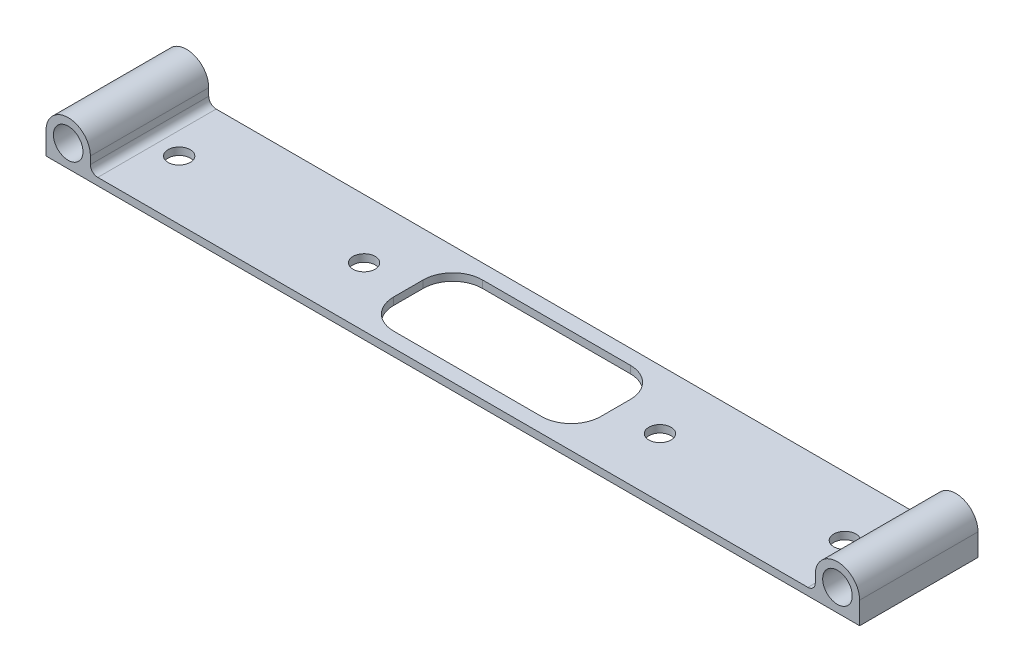
ISO-10303-21;
HEADER;
FILE_DESCRIPTION(('STEP AP214'),'2;1');
FILE_NAME('part.step','',(''),(''),'','','');
FILE_SCHEMA(('AUTOMOTIVE_DESIGN { 1 0 10303 214 1 1 1 1 }'));
ENDSEC;
DATA;
#1=APPLICATION_CONTEXT('core data for automotive mechanical design processes');
#2=APPLICATION_PROTOCOL_DEFINITION('international standard','automotive_design',2000,#1);
#3=PRODUCT_CONTEXT('',#1,'mechanical');
#4=PRODUCT('Part','Part','',(#3));
#5=PRODUCT_RELATED_PRODUCT_CATEGORY('part','',(#4));
#6=PRODUCT_DEFINITION_FORMATION('','',#4);
#7=PRODUCT_DEFINITION_CONTEXT('part definition',#1,'design');
#8=PRODUCT_DEFINITION('design','',#6,#7);
#9=PRODUCT_DEFINITION_SHAPE('','',#8);
#10=(LENGTH_UNIT() NAMED_UNIT(*) SI_UNIT(.MILLI.,.METRE.));
#11=(NAMED_UNIT(*) PLANE_ANGLE_UNIT() SI_UNIT($,.RADIAN.));
#12=(NAMED_UNIT(*) SI_UNIT($,.STERADIAN.) SOLID_ANGLE_UNIT());
#13=UNCERTAINTY_MEASURE_WITH_UNIT(LENGTH_MEASURE(1.E-05),#10,'distance_accuracy_value','');
#14=(GEOMETRIC_REPRESENTATION_CONTEXT(3) GLOBAL_UNCERTAINTY_ASSIGNED_CONTEXT((#13)) GLOBAL_UNIT_ASSIGNED_CONTEXT((#10,
#11,#12)) REPRESENTATION_CONTEXT('',''));
#15=CARTESIAN_POINT('',(0.,0.,0.));
#16=DIRECTION('',(0.,0.,1.));
#17=DIRECTION('',(1.,0.,0.));
#18=AXIS2_PLACEMENT_3D('',#15,#16,#17);
#19=CARTESIAN_POINT('',(-9.525,0.,50.8));
#20=DIRECTION('',(1.,0.,0.));
#21=DIRECTION('',(0.,1.,0.));
#22=AXIS2_PLACEMENT_3D('',#19,#20,#21);
#23=PLANE('',#22);
#24=DIRECTION('',(0.,-1.,0.));
#25=VECTOR('',#24,1.);
#26=CARTESIAN_POINT('',(-9.525,0.,0.));
#27=LINE('',#26,#25);
#28=CARTESIAN_POINT('',(-9.525,0.,0.));
#29=VERTEX_POINT('',#28);
#30=CARTESIAN_POINT('',(-9.525,-9.525,0.));
#31=VERTEX_POINT('',#30);
#32=EDGE_CURVE('E238',#29,#31,#27,.T.);
#33=ORIENTED_EDGE('',*,*,#32,.T.);
#34=DIRECTION('',(0.,0.,-1.));
#35=VECTOR('',#34,1.);
#36=CARTESIAN_POINT('',(-9.525,-9.525,50.8));
#37=LINE('',#36,#35);
#38=CARTESIAN_POINT('',(-9.525,-9.525,50.8));
#39=VERTEX_POINT('',#38);
#40=EDGE_CURVE('E253',#39,#31,#37,.T.);
#41=ORIENTED_EDGE('',*,*,#40,.F.);
#42=DIRECTION('',(0.,-1.,0.));
#43=VECTOR('',#42,1.);
#44=CARTESIAN_POINT('',(-9.525,0.,50.8));
#45=LINE('',#44,#43);
#46=CARTESIAN_POINT('',(-9.525,0.,50.8));
#47=VERTEX_POINT('',#46);
#48=EDGE_CURVE('E222',#47,#39,#45,.T.);
#49=ORIENTED_EDGE('',*,*,#48,.F.);
#50=DIRECTION('',(0.,0.,-1.));
#51=VECTOR('',#50,1.);
#52=CARTESIAN_POINT('',(-9.525,0.,50.8));
#53=LINE('',#52,#51);
#54=EDGE_CURVE('E235',#47,#29,#53,.T.);
#55=ORIENTED_EDGE('',*,*,#54,.T.);
#56=EDGE_LOOP('',(#33,#41,#49,#55));
#57=FACE_BOUND('',#56,.T.);
#58=ADVANCED_FACE('F38',(#57),#23,.F.);
#59=CARTESIAN_POINT('',(0.,-9.52500000000001,50.8));
#60=DIRECTION('',(0.,1.,0.));
#61=DIRECTION('',(-1.,0.,0.));
#62=AXIS2_PLACEMENT_3D('',#59,#60,#61);
#63=PLANE('',#62);
#64=DIRECTION('',(1.,0.,0.));
#65=VECTOR('',#64,1.);
#66=CARTESIAN_POINT('',(0.,-9.52500000000029,6.35));
#67=LINE('',#66,#65);
#68=CARTESIAN_POINT('',(133.35,-9.52500000000029,6.35));
#69=VERTEX_POINT('',#68);
#70=CARTESIAN_POINT('',(196.85,-9.52500000000029,6.35));
#71=VERTEX_POINT('',#70);
#72=EDGE_CURVE('E670',#69,#71,#67,.T.);
#73=ORIENTED_EDGE('',*,*,#72,.F.);
#74=CARTESIAN_POINT('',(133.35,-9.52500000000013,19.05));
#75=DIRECTION('',(0.,1.,0.));
#76=DIRECTION('',(-1.,0.,0.));
#77=AXIS2_PLACEMENT_3D('',#74,#75,#76);
#78=CIRCLE('',#77,12.7);
#79=CARTESIAN_POINT('',(120.65,-9.52500000000029,19.05));
#80=VERTEX_POINT('',#79);
#81=EDGE_CURVE('E290',#69,#80,#78,.T.);
#82=ORIENTED_EDGE('',*,*,#81,.T.);
#83=DIRECTION('',(0.,0.,1.));
#84=VECTOR('',#83,1.);
#85=CARTESIAN_POINT('',(120.65,-9.52500000000029,0.));
#86=LINE('',#85,#84);
#87=CARTESIAN_POINT('',(120.65,-9.52500000000029,31.75));
#88=VERTEX_POINT('',#87);
#89=EDGE_CURVE('E675',#80,#88,#86,.T.);
#90=ORIENTED_EDGE('',*,*,#89,.T.);
#91=CARTESIAN_POINT('',(133.35,-9.52500000000013,31.75));
#92=DIRECTION('',(0.,1.,0.));
#93=DIRECTION('',(-1.,0.,0.));
#94=AXIS2_PLACEMENT_3D('',#91,#92,#93);
#95=CIRCLE('',#94,12.7);
#96=CARTESIAN_POINT('',(133.35,-9.52500000000029,44.45));
#97=VERTEX_POINT('',#96);
#98=EDGE_CURVE('E286',#88,#97,#95,.T.);
#99=ORIENTED_EDGE('',*,*,#98,.T.);
#100=DIRECTION('',(1.,0.,0.));
#101=VECTOR('',#100,1.);
#102=CARTESIAN_POINT('',(0.,-9.52500000000029,44.45));
#103=LINE('',#102,#101);
#104=CARTESIAN_POINT('',(196.85,-9.52500000000029,44.45));
#105=VERTEX_POINT('',#104);
#106=EDGE_CURVE('E690',#97,#105,#103,.T.);
#107=ORIENTED_EDGE('',*,*,#106,.T.);
#108=CARTESIAN_POINT('',(196.85,-9.52500000000019,31.75));
#109=DIRECTION('',(0.,1.,0.));
#110=DIRECTION('',(-1.,0.,0.));
#111=AXIS2_PLACEMENT_3D('',#108,#109,#110);
#112=CIRCLE('',#111,12.7);
#113=CARTESIAN_POINT('',(209.55,-9.52500000000029,31.75));
#114=VERTEX_POINT('',#113);
#115=EDGE_CURVE('E282',#105,#114,#112,.T.);
#116=ORIENTED_EDGE('',*,*,#115,.T.);
#117=DIRECTION('',(0.,0.,1.));
#118=VECTOR('',#117,1.);
#119=CARTESIAN_POINT('',(209.55,-9.52500000000029,0.));
#120=LINE('',#119,#118);
#121=CARTESIAN_POINT('',(209.55,-9.52500000000029,19.05));
#122=VERTEX_POINT('',#121);
#123=EDGE_CURVE('E687',#122,#114,#120,.T.);
#124=ORIENTED_EDGE('',*,*,#123,.F.);
#125=CARTESIAN_POINT('',(196.85,-9.52500000000019,19.05));
#126=DIRECTION('',(0.,1.,0.));
#127=DIRECTION('',(-1.,0.,0.));
#128=AXIS2_PLACEMENT_3D('',#125,#126,#127);
#129=CIRCLE('',#128,12.7);
#130=EDGE_CURVE('E278',#122,#71,#129,.T.);
#131=ORIENTED_EDGE('',*,*,#130,.T.);
#132=EDGE_LOOP('',(#73,#82,#90,#99,#107,#116,#124,#131));
#133=FACE_BOUND('',#132,.T.);
#134=CARTESIAN_POINT('',(307.975,-9.52500000000029,25.4));
#135=DIRECTION('',(0.,1.,0.));
#136=DIRECTION('',(-1.,0.,0.));
#137=AXIS2_PLACEMENT_3D('',#134,#135,#136);
#138=CIRCLE('',#137,4.76250000000001);
#139=CARTESIAN_POINT('',(303.2125,-9.52500000000029,25.4));
#140=VERTEX_POINT('',#139);
#141=EDGE_CURVE('E200',#140,#140,#138,.F.);
#142=ORIENTED_EDGE('',*,*,#141,.F.);
#143=EDGE_LOOP('',(#142));
#144=FACE_BOUND('',#143,.T.);
#145=CARTESIAN_POINT('',(228.6,-9.52500000000022,25.4));
#146=DIRECTION('',(0.,1.,0.));
#147=DIRECTION('',(-1.,0.,0.));
#148=AXIS2_PLACEMENT_3D('',#145,#146,#147);
#149=CIRCLE('',#148,4.76250000000001);
#150=CARTESIAN_POINT('',(223.8375,-9.52500000000021,25.4));
#151=VERTEX_POINT('',#150);
#152=EDGE_CURVE('E662',#151,#151,#149,.F.);
#153=ORIENTED_EDGE('',*,*,#152,.F.);
#154=EDGE_LOOP('',(#153));
#155=FACE_BOUND('',#154,.T.);
#156=CARTESIAN_POINT('',(22.225,-9.52500000000003,25.4));
#157=DIRECTION('',(0.,1.,0.));
#158=DIRECTION('',(-1.,0.,0.));
#159=AXIS2_PLACEMENT_3D('',#156,#157,#158);
#160=CIRCLE('',#159,4.76250000000001);
#161=CARTESIAN_POINT('',(17.4625,-9.52500000000003,25.4));
#162=VERTEX_POINT('',#161);
#163=EDGE_CURVE('E215',#162,#162,#160,.T.);
#164=ORIENTED_EDGE('',*,*,#163,.T.);
#165=EDGE_LOOP('',(#164));
#166=FACE_BOUND('',#165,.T.);
#167=CARTESIAN_POINT('',(101.6,-9.5250000000001,25.4));
#168=DIRECTION('',(0.,1.,0.));
#169=DIRECTION('',(-1.,0.,0.));
#170=AXIS2_PLACEMENT_3D('',#167,#168,#169);
#171=CIRCLE('',#170,4.76250000000001);
#172=CARTESIAN_POINT('',(96.8375,-9.5250000000001,25.4));
#173=VERTEX_POINT('',#172);
#174=EDGE_CURVE('E210',#173,#173,#171,.T.);
#175=ORIENTED_EDGE('',*,*,#174,.T.);
#176=EDGE_LOOP('',(#175));
#177=FACE_BOUND('',#176,.T.);
#178=DIRECTION('',(1.,0.,0.));
#179=VECTOR('',#178,1.);
#180=CARTESIAN_POINT('',(0.,-9.52500000000001,0.));
#181=LINE('',#180,#179);
#182=CARTESIAN_POINT('',(339.725,-9.525,0.));
#183=VERTEX_POINT('',#182);
#184=EDGE_CURVE('E241',#31,#183,#181,.T.);
#185=ORIENTED_EDGE('',*,*,#184,.T.);
#186=DIRECTION('',(0.,0.,-1.));
#187=VECTOR('',#186,1.);
#188=CARTESIAN_POINT('',(339.725,-9.525,50.8));
#189=LINE('',#188,#187);
#190=CARTESIAN_POINT('',(339.725,-9.525,50.8));
#191=VERTEX_POINT('',#190);
#192=EDGE_CURVE('E196',#191,#183,#189,.T.);
#193=ORIENTED_EDGE('',*,*,#192,.F.);
#194=DIRECTION('',(1.,0.,0.));
#195=VECTOR('',#194,1.);
#196=CARTESIAN_POINT('',(0.,-9.52500000000001,50.8));
#197=LINE('',#196,#195);
#198=EDGE_CURVE('E186',#39,#191,#197,.T.);
#199=ORIENTED_EDGE('',*,*,#198,.F.);
#200=ORIENTED_EDGE('',*,*,#40,.T.);
#201=EDGE_LOOP('',(#185,#193,#199,#200));
#202=FACE_BOUND('',#201,.T.);
#203=ADVANCED_FACE('F328',(#133,#144,#155,#166,#177,#202),#63,.F.);
#204=CARTESIAN_POINT('',(0.,-6.35,50.8));
#205=DIRECTION('',(0.,1.,0.));
#206=DIRECTION('',(-1.,0.,0.));
#207=AXIS2_PLACEMENT_3D('',#204,#205,#206);
#208=PLANE('',#207);
#209=DIRECTION('',(0.,0.,1.));
#210=VECTOR('',#209,1.);
#211=CARTESIAN_POINT('',(120.65,-6.35,0.));
#212=LINE('',#211,#210);
#213=CARTESIAN_POINT('',(120.65,-6.35,19.05));
#214=VERTEX_POINT('',#213);
#215=CARTESIAN_POINT('',(120.65,-6.35,31.75));
#216=VERTEX_POINT('',#215);
#217=EDGE_CURVE('E682',#214,#216,#212,.T.);
#218=ORIENTED_EDGE('',*,*,#217,.F.);
#219=CARTESIAN_POINT('',(133.35,-6.35,19.05));
#220=DIRECTION('',(0.,1.,0.));
#221=DIRECTION('',(-1.,0.,0.));
#222=AXIS2_PLACEMENT_3D('',#219,#220,#221);
#223=CIRCLE('',#222,12.7);
#224=CARTESIAN_POINT('',(133.35,-6.35,6.35));
#225=VERTEX_POINT('',#224);
#226=EDGE_CURVE('E288',#214,#225,#223,.F.);
#227=ORIENTED_EDGE('',*,*,#226,.T.);
#228=DIRECTION('',(1.,0.,0.));
#229=VECTOR('',#228,1.);
#230=CARTESIAN_POINT('',(0.,-6.35,6.35));
#231=LINE('',#230,#229);
#232=CARTESIAN_POINT('',(196.85,-6.35,6.35));
#233=VERTEX_POINT('',#232);
#234=EDGE_CURVE('E672',#225,#233,#231,.T.);
#235=ORIENTED_EDGE('',*,*,#234,.T.);
#236=CARTESIAN_POINT('',(196.85,-6.35,19.05));
#237=DIRECTION('',(0.,1.,0.));
#238=DIRECTION('',(-1.,0.,0.));
#239=AXIS2_PLACEMENT_3D('',#236,#237,#238);
#240=CIRCLE('',#239,12.7);
#241=CARTESIAN_POINT('',(209.55,-6.35,19.05));
#242=VERTEX_POINT('',#241);
#243=EDGE_CURVE('E276',#233,#242,#240,.F.);
#244=ORIENTED_EDGE('',*,*,#243,.T.);
#245=DIRECTION('',(0.,0.,1.));
#246=VECTOR('',#245,1.);
#247=CARTESIAN_POINT('',(209.55,-6.35,0.));
#248=LINE('',#247,#246);
#249=CARTESIAN_POINT('',(209.55,-6.35,31.75));
#250=VERTEX_POINT('',#249);
#251=EDGE_CURVE('E676',#242,#250,#248,.T.);
#252=ORIENTED_EDGE('',*,*,#251,.T.);
#253=CARTESIAN_POINT('',(196.85,-6.35,31.75));
#254=DIRECTION('',(0.,1.,0.));
#255=DIRECTION('',(-1.,0.,0.));
#256=AXIS2_PLACEMENT_3D('',#253,#254,#255);
#257=CIRCLE('',#256,12.7);
#258=CARTESIAN_POINT('',(196.85,-6.35,44.45));
#259=VERTEX_POINT('',#258);
#260=EDGE_CURVE('E280',#250,#259,#257,.F.);
#261=ORIENTED_EDGE('',*,*,#260,.T.);
#262=DIRECTION('',(1.,0.,0.));
#263=VECTOR('',#262,1.);
#264=CARTESIAN_POINT('',(0.,-6.35,44.45));
#265=LINE('',#264,#263);
#266=CARTESIAN_POINT('',(133.35,-6.35,44.45));
#267=VERTEX_POINT('',#266);
#268=EDGE_CURVE('E679',#267,#259,#265,.T.);
#269=ORIENTED_EDGE('',*,*,#268,.F.);
#270=CARTESIAN_POINT('',(133.35,-6.35,31.75));
#271=DIRECTION('',(0.,1.,0.));
#272=DIRECTION('',(-1.,0.,0.));
#273=AXIS2_PLACEMENT_3D('',#270,#271,#272);
#274=CIRCLE('',#273,12.7);
#275=EDGE_CURVE('E284',#267,#216,#274,.F.);
#276=ORIENTED_EDGE('',*,*,#275,.T.);
#277=EDGE_LOOP('',(#218,#227,#235,#244,#252,#261,#269,#276));
#278=FACE_BOUND('',#277,.T.);
#279=CARTESIAN_POINT('',(307.975,-6.35,25.4));
#280=DIRECTION('',(0.,-1.,0.));
#281=DIRECTION('',(1.,0.,0.));
#282=AXIS2_PLACEMENT_3D('',#279,#280,#281);
#283=CIRCLE('',#282,4.76250000000001);
#284=CARTESIAN_POINT('',(312.7375,-6.35,25.4));
#285=VERTEX_POINT('',#284);
#286=EDGE_CURVE('E664',#285,#285,#283,.T.);
#287=ORIENTED_EDGE('',*,*,#286,.T.);
#288=EDGE_LOOP('',(#287));
#289=FACE_BOUND('',#288,.T.);
#290=CARTESIAN_POINT('',(228.6,-6.35000000000001,25.4));
#291=DIRECTION('',(0.,-1.,0.));
#292=DIRECTION('',(1.,0.,0.));
#293=AXIS2_PLACEMENT_3D('',#290,#291,#292);
#294=CIRCLE('',#293,4.76250000000001);
#295=CARTESIAN_POINT('',(233.3625,-6.35000000000001,25.4));
#296=VERTEX_POINT('',#295);
#297=EDGE_CURVE('E659',#296,#296,#294,.T.);
#298=ORIENTED_EDGE('',*,*,#297,.T.);
#299=EDGE_LOOP('',(#298));
#300=FACE_BOUND('',#299,.T.);
#301=CARTESIAN_POINT('',(22.225,-6.35,25.4));
#302=DIRECTION('',(0.,1.,0.));
#303=DIRECTION('',(-1.,0.,0.));
#304=AXIS2_PLACEMENT_3D('',#301,#302,#303);
#305=CIRCLE('',#304,4.76250000000001);
#306=CARTESIAN_POINT('',(17.4625,-6.35,25.4));
#307=VERTEX_POINT('',#306);
#308=EDGE_CURVE('E207',#307,#307,#305,.T.);
#309=ORIENTED_EDGE('',*,*,#308,.F.);
#310=EDGE_LOOP('',(#309));
#311=FACE_BOUND('',#310,.T.);
#312=CARTESIAN_POINT('',(101.6,-6.35000000000001,25.4));
#313=DIRECTION('',(0.,1.,0.));
#314=DIRECTION('',(-1.,0.,0.));
#315=AXIS2_PLACEMENT_3D('',#312,#313,#314);
#316=CIRCLE('',#315,4.76250000000001);
#317=CARTESIAN_POINT('',(96.8375,-6.35000000000001,25.4));
#318=VERTEX_POINT('',#317);
#319=EDGE_CURVE('E172',#318,#318,#316,.T.);
#320=ORIENTED_EDGE('',*,*,#319,.F.);
#321=EDGE_LOOP('',(#320));
#322=FACE_BOUND('',#321,.T.);
#323=DIRECTION('',(1.,0.,0.));
#324=VECTOR('',#323,1.);
#325=CARTESIAN_POINT('',(0.,-6.35,0.));
#326=LINE('',#325,#324);
#327=CARTESIAN_POINT('',(12.7,-6.35,0.));
#328=VERTEX_POINT('',#327);
#329=CARTESIAN_POINT('',(317.5,-6.35,0.));
#330=VERTEX_POINT('',#329);
#331=EDGE_CURVE('E243',#328,#330,#326,.T.);
#332=ORIENTED_EDGE('',*,*,#331,.F.);
#333=DIRECTION('',(0.,0.,-1.));
#334=VECTOR('',#333,1.);
#335=CARTESIAN_POINT('',(12.7,-6.35,50.8));
#336=LINE('',#335,#334);
#337=CARTESIAN_POINT('',(12.7,-6.35,50.8));
#338=VERTEX_POINT('',#337);
#339=EDGE_CURVE('E298',#328,#338,#336,.F.);
#340=ORIENTED_EDGE('',*,*,#339,.T.);
#341=DIRECTION('',(1.,0.,0.));
#342=VECTOR('',#341,1.);
#343=CARTESIAN_POINT('',(0.,-6.35,50.8));
#344=LINE('',#343,#342);
#345=CARTESIAN_POINT('',(317.5,-6.35,50.8));
#346=VERTEX_POINT('',#345);
#347=EDGE_CURVE('E226',#338,#346,#344,.T.);
#348=ORIENTED_EDGE('',*,*,#347,.T.);
#349=DIRECTION('',(0.,0.,-1.));
#350=VECTOR('',#349,1.);
#351=CARTESIAN_POINT('',(317.5,-6.35,50.8));
#352=LINE('',#351,#350);
#353=EDGE_CURVE('E295',#346,#330,#352,.T.);
#354=ORIENTED_EDGE('',*,*,#353,.T.);
#355=EDGE_LOOP('',(#332,#340,#348,#354));
#356=FACE_BOUND('',#355,.T.);
#357=ADVANCED_FACE('F320',(#278,#289,#300,#311,#322,#356),#208,.T.);
#358=CARTESIAN_POINT('',(9.525,0.,50.8));
#359=DIRECTION('',(1.,0.,0.));
#360=DIRECTION('',(0.,0.,-1.));
#361=AXIS2_PLACEMENT_3D('',#358,#359,#360);
#362=PLANE('',#361);
#363=DIRECTION('',(0.,-1.,0.));
#364=VECTOR('',#363,1.);
#365=CARTESIAN_POINT('',(9.525,0.,50.8));
#366=LINE('',#365,#364);
#367=CARTESIAN_POINT('',(9.525,0.,50.8));
#368=VERTEX_POINT('',#367);
#369=CARTESIAN_POINT('',(9.525,-3.175,50.8));
#370=VERTEX_POINT('',#369);
#371=EDGE_CURVE('E229',#368,#370,#366,.T.);
#372=ORIENTED_EDGE('',*,*,#371,.T.);
#373=DIRECTION('',(0.,0.,-1.));
#374=VECTOR('',#373,1.);
#375=CARTESIAN_POINT('',(9.525,-3.175,0.));
#376=LINE('',#375,#374);
#377=CARTESIAN_POINT('',(9.525,-3.175,0.));
#378=VERTEX_POINT('',#377);
#379=EDGE_CURVE('E292',#370,#378,#376,.T.);
#380=ORIENTED_EDGE('',*,*,#379,.T.);
#381=DIRECTION('',(0.,-1.,0.));
#382=VECTOR('',#381,1.);
#383=CARTESIAN_POINT('',(9.525,0.,0.));
#384=LINE('',#383,#382);
#385=CARTESIAN_POINT('',(9.525,0.,0.));
#386=VERTEX_POINT('',#385);
#387=EDGE_CURVE('E245',#386,#378,#384,.T.);
#388=ORIENTED_EDGE('',*,*,#387,.F.);
#389=DIRECTION('',(0.,0.,-1.));
#390=VECTOR('',#389,1.);
#391=CARTESIAN_POINT('',(9.525,0.,50.8));
#392=LINE('',#391,#390);
#393=EDGE_CURVE('E251',#368,#386,#392,.T.);
#394=ORIENTED_EDGE('',*,*,#393,.F.);
#395=EDGE_LOOP('',(#372,#380,#388,#394));
#396=FACE_BOUND('',#395,.T.);
#397=ADVANCED_FACE('F312',(#396),#362,.T.);
#398=CARTESIAN_POINT('',(0.,0.,50.8));
#399=DIRECTION('',(0.,0.,-1.));
#400=DIRECTION('',(-1.,0.,0.));
#401=AXIS2_PLACEMENT_3D('',#398,#399,#400);
#402=CYLINDRICAL_SURFACE('',#401,6.35);
#403=CARTESIAN_POINT('',(0.,0.,50.8));
#404=DIRECTION('',(0.,0.,1.));
#405=DIRECTION('',(1.,0.,0.));
#406=AXIS2_PLACEMENT_3D('',#403,#404,#405);
#407=CIRCLE('',#406,6.35);
#408=CARTESIAN_POINT('',(6.34999999999999,0.,50.8));
#409=VERTEX_POINT('',#408);
#410=EDGE_CURVE('E219',#409,#409,#407,.T.);
#411=ORIENTED_EDGE('',*,*,#410,.T.);
#412=EDGE_LOOP('',(#411));
#413=FACE_BOUND('',#412,.T.);
#414=CARTESIAN_POINT('',(0.,0.,0.));
#415=DIRECTION('',(0.,0.,1.));
#416=DIRECTION('',(1.,0.,0.));
#417=AXIS2_PLACEMENT_3D('',#414,#415,#416);
#418=CIRCLE('',#417,6.35);
#419=CARTESIAN_POINT('',(6.34999999999999,0.,0.));
#420=VERTEX_POINT('',#419);
#421=EDGE_CURVE('E218',#420,#420,#418,.T.);
#422=ORIENTED_EDGE('',*,*,#421,.F.);
#423=EDGE_LOOP('',(#422));
#424=FACE_BOUND('',#423,.T.);
#425=ADVANCED_FACE('F334',(#413,#424),#402,.F.);
#426=CARTESIAN_POINT('',(0.,0.,50.8));
#427=DIRECTION('',(0.,0.,-1.));
#428=DIRECTION('',(-1.,0.,0.));
#429=AXIS2_PLACEMENT_3D('',#426,#427,#428);
#430=CYLINDRICAL_SURFACE('',#429,9.525);
#431=CARTESIAN_POINT('',(0.,0.,0.));
#432=DIRECTION('',(0.,0.,1.));
#433=DIRECTION('',(1.,0.,0.));
#434=AXIS2_PLACEMENT_3D('',#431,#432,#433);
#435=CIRCLE('',#434,9.525);
#436=EDGE_CURVE('E223',#29,#386,#435,.F.);
#437=ORIENTED_EDGE('',*,*,#436,.F.);
#438=ORIENTED_EDGE('',*,*,#54,.F.);
#439=CARTESIAN_POINT('',(0.,0.,50.8));
#440=DIRECTION('',(0.,0.,1.));
#441=DIRECTION('',(1.,0.,0.));
#442=AXIS2_PLACEMENT_3D('',#439,#440,#441);
#443=CIRCLE('',#442,9.525);
#444=EDGE_CURVE('E232',#47,#368,#443,.F.);
#445=ORIENTED_EDGE('',*,*,#444,.T.);
#446=ORIENTED_EDGE('',*,*,#393,.T.);
#447=EDGE_LOOP('',(#437,#438,#445,#446));
#448=FACE_BOUND('',#447,.T.);
#449=ADVANCED_FACE('F332',(#448),#430,.T.);
#450=CARTESIAN_POINT('',(0.,0.,50.8));
#451=DIRECTION('',(0.,0.,1.));
#452=DIRECTION('',(1.,0.,0.));
#453=AXIS2_PLACEMENT_3D('',#450,#451,#452);
#454=PLANE('',#453);
#455=ORIENTED_EDGE('',*,*,#410,.F.);
#456=EDGE_LOOP('',(#455));
#457=FACE_BOUND('',#456,.T.);
#458=ORIENTED_EDGE('',*,*,#48,.T.);
#459=ORIENTED_EDGE('',*,*,#198,.T.);
#460=DIRECTION('',(0.,-1.,0.));
#461=VECTOR('',#460,1.);
#462=CARTESIAN_POINT('',(339.725,0.,50.8));
#463=LINE('',#462,#461);
#464=CARTESIAN_POINT('',(339.725,0.,50.8));
#465=VERTEX_POINT('',#464);
#466=EDGE_CURVE('E166',#465,#191,#463,.T.);
#467=ORIENTED_EDGE('',*,*,#466,.F.);
#468=CARTESIAN_POINT('',(330.2,0.,50.8));
#469=DIRECTION('',(0.,0.,-1.));
#470=DIRECTION('',(-1.,0.,0.));
#471=AXIS2_PLACEMENT_3D('',#468,#469,#470);
#472=CIRCLE('',#471,9.525);
#473=CARTESIAN_POINT('',(320.675,0.,50.8));
#474=VERTEX_POINT('',#473);
#475=EDGE_CURVE('E177',#465,#474,#472,.F.);
#476=ORIENTED_EDGE('',*,*,#475,.T.);
#477=DIRECTION('',(0.,-1.,0.));
#478=VECTOR('',#477,1.);
#479=CARTESIAN_POINT('',(320.675,0.,50.8));
#480=LINE('',#479,#478);
#481=CARTESIAN_POINT('',(320.675,-3.175,50.8));
#482=VERTEX_POINT('',#481);
#483=EDGE_CURVE('E181',#474,#482,#480,.T.);
#484=ORIENTED_EDGE('',*,*,#483,.T.);
#485=CARTESIAN_POINT('',(317.5,-3.175,50.8));
#486=DIRECTION('',(0.,0.,1.));
#487=DIRECTION('',(1.,0.,0.));
#488=AXIS2_PLACEMENT_3D('',#485,#486,#487);
#489=CIRCLE('',#488,3.175);
#490=EDGE_CURVE('E11',#482,#346,#489,.F.);
#491=ORIENTED_EDGE('',*,*,#490,.T.);
#492=ORIENTED_EDGE('',*,*,#347,.F.);
#493=CARTESIAN_POINT('',(12.7,-3.175,50.8));
#494=DIRECTION('',(0.,0.,1.));
#495=DIRECTION('',(1.,0.,0.));
#496=AXIS2_PLACEMENT_3D('',#493,#494,#495);
#497=CIRCLE('',#496,3.175);
#498=EDGE_CURVE('E303',#338,#370,#497,.F.);
#499=ORIENTED_EDGE('',*,*,#498,.T.);
#500=ORIENTED_EDGE('',*,*,#371,.F.);
#501=ORIENTED_EDGE('',*,*,#444,.F.);
#502=EDGE_LOOP('',(#458,#459,#467,#476,#484,#491,#492,#499,#500,#501));
#503=FACE_BOUND('',#502,.T.);
#504=CARTESIAN_POINT('',(330.2,0.,50.8));
#505=DIRECTION('',(0.,0.,-1.));
#506=DIRECTION('',(-1.,0.,0.));
#507=AXIS2_PLACEMENT_3D('',#504,#505,#506);
#508=CIRCLE('',#507,6.35);
#509=CARTESIAN_POINT('',(323.85,0.,50.8));
#510=VERTEX_POINT('',#509);
#511=EDGE_CURVE('E188',#510,#510,#508,.T.);
#512=ORIENTED_EDGE('',*,*,#511,.T.);
#513=EDGE_LOOP('',(#512));
#514=FACE_BOUND('',#513,.T.);
#515=ADVANCED_FACE('F184',(#457,#503,#514),#454,.T.);
#516=CARTESIAN_POINT('',(0.,0.,0.));
#517=DIRECTION('',(0.,0.,1.));
#518=DIRECTION('',(1.,0.,0.));
#519=AXIS2_PLACEMENT_3D('',#516,#517,#518);
#520=PLANE('',#519);
#521=ORIENTED_EDGE('',*,*,#421,.T.);
#522=EDGE_LOOP('',(#521));
#523=FACE_BOUND('',#522,.T.);
#524=ORIENTED_EDGE('',*,*,#32,.F.);
#525=ORIENTED_EDGE('',*,*,#436,.T.);
#526=ORIENTED_EDGE('',*,*,#387,.T.);
#527=CARTESIAN_POINT('',(12.7,-3.175,0.));
#528=DIRECTION('',(0.,0.,1.));
#529=DIRECTION('',(1.,0.,0.));
#530=AXIS2_PLACEMENT_3D('',#527,#528,#529);
#531=CIRCLE('',#530,3.175);
#532=EDGE_CURVE('E301',#378,#328,#531,.T.);
#533=ORIENTED_EDGE('',*,*,#532,.T.);
#534=ORIENTED_EDGE('',*,*,#331,.T.);
#535=CARTESIAN_POINT('',(317.5,-3.175,0.));
#536=DIRECTION('',(0.,0.,1.));
#537=DIRECTION('',(1.,0.,0.));
#538=AXIS2_PLACEMENT_3D('',#535,#536,#537);
#539=CIRCLE('',#538,3.175);
#540=CARTESIAN_POINT('',(320.675,-3.175,0.));
#541=VERTEX_POINT('',#540);
#542=EDGE_CURVE('E46',#330,#541,#539,.T.);
#543=ORIENTED_EDGE('',*,*,#542,.T.);
#544=DIRECTION('',(0.,-1.,0.));
#545=VECTOR('',#544,1.);
#546=CARTESIAN_POINT('',(320.675,0.,0.));
#547=LINE('',#546,#545);
#548=CARTESIAN_POINT('',(320.675,0.,0.));
#549=VERTEX_POINT('',#548);
#550=EDGE_CURVE('E191',#549,#541,#547,.T.);
#551=ORIENTED_EDGE('',*,*,#550,.F.);
#552=CARTESIAN_POINT('',(330.2,0.,0.));
#553=DIRECTION('',(0.,0.,-1.));
#554=DIRECTION('',(-1.,0.,0.));
#555=AXIS2_PLACEMENT_3D('',#552,#553,#554);
#556=CIRCLE('',#555,9.525);
#557=CARTESIAN_POINT('',(339.725,0.,0.));
#558=VERTEX_POINT('',#557);
#559=EDGE_CURVE('E202',#558,#549,#556,.F.);
#560=ORIENTED_EDGE('',*,*,#559,.F.);
#561=DIRECTION('',(0.,-1.,0.));
#562=VECTOR('',#561,1.);
#563=CARTESIAN_POINT('',(339.725,0.,0.));
#564=LINE('',#563,#562);
#565=EDGE_CURVE('E168',#558,#183,#564,.T.);
#566=ORIENTED_EDGE('',*,*,#565,.T.);
#567=ORIENTED_EDGE('',*,*,#184,.F.);
#568=EDGE_LOOP('',(#524,#525,#526,#533,#534,#543,#551,#560,#566,#567));
#569=FACE_BOUND('',#568,.T.);
#570=CARTESIAN_POINT('',(330.2,0.,0.));
#571=DIRECTION('',(0.,0.,-1.));
#572=DIRECTION('',(-1.,0.,0.));
#573=AXIS2_PLACEMENT_3D('',#570,#571,#572);
#574=CIRCLE('',#573,6.35);
#575=CARTESIAN_POINT('',(323.85,0.,0.));
#576=VERTEX_POINT('',#575);
#577=EDGE_CURVE('E197',#576,#576,#574,.T.);
#578=ORIENTED_EDGE('',*,*,#577,.F.);
#579=EDGE_LOOP('',(#578));
#580=FACE_BOUND('',#579,.T.);
#581=ADVANCED_FACE('F317',(#523,#569,#580),#520,.F.);
#582=CARTESIAN_POINT('',(101.6,-19.05,25.4));
#583=DIRECTION('',(0.,1.,0.));
#584=DIRECTION('',(-1.,0.,0.));
#585=AXIS2_PLACEMENT_3D('',#582,#583,#584);
#586=CYLINDRICAL_SURFACE('',#585,4.76250000000001);
#587=ORIENTED_EDGE('',*,*,#319,.T.);
#588=EDGE_LOOP('',(#587));
#589=FACE_BOUND('',#588,.T.);
#590=ORIENTED_EDGE('',*,*,#174,.F.);
#591=EDGE_LOOP('',(#590));
#592=FACE_BOUND('',#591,.T.);
#593=ADVANCED_FACE('F404',(#589,#592),#586,.F.);
#594=CARTESIAN_POINT('',(22.225,-19.05,25.4));
#595=DIRECTION('',(0.,1.,0.));
#596=DIRECTION('',(-1.,0.,0.));
#597=AXIS2_PLACEMENT_3D('',#594,#595,#596);
#598=CYLINDRICAL_SURFACE('',#597,4.76250000000001);
#599=ORIENTED_EDGE('',*,*,#308,.T.);
#600=EDGE_LOOP('',(#599));
#601=FACE_BOUND('',#600,.T.);
#602=ORIENTED_EDGE('',*,*,#163,.F.);
#603=EDGE_LOOP('',(#602));
#604=FACE_BOUND('',#603,.T.);
#605=ADVANCED_FACE('F544',(#601,#604),#598,.F.);
#606=CARTESIAN_POINT('',(339.725,0.,50.8));
#607=DIRECTION('',(1.,0.,0.));
#608=DIRECTION('',(0.,1.,0.));
#609=AXIS2_PLACEMENT_3D('',#606,#607,#608);
#610=PLANE('',#609);
#611=ORIENTED_EDGE('',*,*,#565,.F.);
#612=DIRECTION('',(0.,0.,-1.));
#613=VECTOR('',#612,1.);
#614=CARTESIAN_POINT('',(339.725,0.,50.8));
#615=LINE('',#614,#613);
#616=EDGE_CURVE('E161',#465,#558,#615,.T.);
#617=ORIENTED_EDGE('',*,*,#616,.F.);
#618=ORIENTED_EDGE('',*,*,#466,.T.);
#619=ORIENTED_EDGE('',*,*,#192,.T.);
#620=EDGE_LOOP('',(#611,#617,#618,#619));
#621=FACE_BOUND('',#620,.T.);
#622=ADVANCED_FACE('F163',(#621),#610,.T.);
#623=CARTESIAN_POINT('',(330.2,0.,50.8));
#624=DIRECTION('',(0.,0.,-1.));
#625=DIRECTION('',(-1.,0.,0.));
#626=AXIS2_PLACEMENT_3D('',#623,#624,#625);
#627=CYLINDRICAL_SURFACE('',#626,9.525);
#628=ORIENTED_EDGE('',*,*,#559,.T.);
#629=DIRECTION('',(0.,0.,-1.));
#630=VECTOR('',#629,1.);
#631=CARTESIAN_POINT('',(320.675,0.,50.8));
#632=LINE('',#631,#630);
#633=EDGE_CURVE('E173',#474,#549,#632,.T.);
#634=ORIENTED_EDGE('',*,*,#633,.F.);
#635=ORIENTED_EDGE('',*,*,#475,.F.);
#636=ORIENTED_EDGE('',*,*,#616,.T.);
#637=EDGE_LOOP('',(#628,#634,#635,#636));
#638=FACE_BOUND('',#637,.T.);
#639=ADVANCED_FACE('F178',(#638),#627,.T.);
#640=CARTESIAN_POINT('',(320.675,0.,50.8));
#641=DIRECTION('',(1.,0.,0.));
#642=DIRECTION('',(0.,0.,-1.));
#643=AXIS2_PLACEMENT_3D('',#640,#641,#642);
#644=PLANE('',#643);
#645=ORIENTED_EDGE('',*,*,#550,.T.);
#646=DIRECTION('',(0.,0.,-1.));
#647=VECTOR('',#646,1.);
#648=CARTESIAN_POINT('',(320.675,-3.175,50.8));
#649=LINE('',#648,#647);
#650=EDGE_CURVE('E53',#541,#482,#649,.F.);
#651=ORIENTED_EDGE('',*,*,#650,.T.);
#652=ORIENTED_EDGE('',*,*,#483,.F.);
#653=ORIENTED_EDGE('',*,*,#633,.T.);
#654=EDGE_LOOP('',(#645,#651,#652,#653));
#655=FACE_BOUND('',#654,.T.);
#656=ADVANCED_FACE('F324',(#655),#644,.F.);
#657=CARTESIAN_POINT('',(330.2,0.,50.8));
#658=DIRECTION('',(0.,0.,-1.));
#659=DIRECTION('',(-1.,0.,0.));
#660=AXIS2_PLACEMENT_3D('',#657,#658,#659);
#661=CYLINDRICAL_SURFACE('',#660,6.35);
#662=ORIENTED_EDGE('',*,*,#511,.F.);
#663=EDGE_LOOP('',(#662));
#664=FACE_BOUND('',#663,.T.);
#665=ORIENTED_EDGE('',*,*,#577,.T.);
#666=EDGE_LOOP('',(#665));
#667=FACE_BOUND('',#666,.T.);
#668=ADVANCED_FACE('F391',(#664,#667),#661,.F.);
#669=CARTESIAN_POINT('',(228.6,-19.05,25.4));
#670=DIRECTION('',(0.,1.,0.));
#671=DIRECTION('',(-1.,0.,0.));
#672=AXIS2_PLACEMENT_3D('',#669,#670,#671);
#673=CYLINDRICAL_SURFACE('',#672,4.76250000000001);
#674=ORIENTED_EDGE('',*,*,#297,.F.);
#675=EDGE_LOOP('',(#674));
#676=FACE_BOUND('',#675,.T.);
#677=ORIENTED_EDGE('',*,*,#152,.T.);
#678=EDGE_LOOP('',(#677));
#679=FACE_BOUND('',#678,.T.);
#680=ADVANCED_FACE('F512',(#676,#679),#673,.F.);
#681=CARTESIAN_POINT('',(307.975,-19.05,25.4));
#682=DIRECTION('',(0.,1.,0.));
#683=DIRECTION('',(-1.,0.,0.));
#684=AXIS2_PLACEMENT_3D('',#681,#682,#683);
#685=CYLINDRICAL_SURFACE('',#684,4.76250000000001);
#686=ORIENTED_EDGE('',*,*,#286,.F.);
#687=EDGE_LOOP('',(#686));
#688=FACE_BOUND('',#687,.T.);
#689=ORIENTED_EDGE('',*,*,#141,.T.);
#690=EDGE_LOOP('',(#689));
#691=FACE_BOUND('',#690,.T.);
#692=ADVANCED_FACE('F496',(#688,#691),#685,.F.);
#693=CARTESIAN_POINT('',(120.65,-9.52500000000029,0.));
#694=DIRECTION('',(-1.,0.,0.));
#695=DIRECTION('',(0.,0.,1.));
#696=AXIS2_PLACEMENT_3D('',#693,#694,#695);
#697=PLANE('',#696);
#698=ORIENTED_EDGE('',*,*,#217,.T.);
#699=DIRECTION('',(0.,1.,0.));
#700=VECTOR('',#699,1.);
#701=CARTESIAN_POINT('',(120.65,-9.52500000000029,31.75));
#702=LINE('',#701,#700);
#703=EDGE_CURVE('E274',#216,#88,#702,.F.);
#704=ORIENTED_EDGE('',*,*,#703,.T.);
#705=ORIENTED_EDGE('',*,*,#89,.F.);
#706=DIRECTION('',(0.,1.,0.));
#707=VECTOR('',#706,1.);
#708=CARTESIAN_POINT('',(120.65,-9.52500000000029,19.05));
#709=LINE('',#708,#707);
#710=EDGE_CURVE('E271',#80,#214,#709,.T.);
#711=ORIENTED_EDGE('',*,*,#710,.T.);
#712=EDGE_LOOP('',(#698,#704,#705,#711));
#713=FACE_BOUND('',#712,.T.);
#714=ADVANCED_FACE('F486',(#713),#697,.F.);
#715=CARTESIAN_POINT('',(0.,-9.52500000000029,6.35));
#716=DIRECTION('',(0.,0.,1.));
#717=DIRECTION('',(1.,0.,0.));
#718=AXIS2_PLACEMENT_3D('',#715,#716,#717);
#719=PLANE('',#718);
#720=ORIENTED_EDGE('',*,*,#72,.T.);
#721=DIRECTION('',(0.,1.,0.));
#722=VECTOR('',#721,1.);
#723=CARTESIAN_POINT('',(196.85,-6.35,6.35));
#724=LINE('',#723,#722);
#725=EDGE_CURVE('E258',#71,#233,#724,.T.);
#726=ORIENTED_EDGE('',*,*,#725,.T.);
#727=ORIENTED_EDGE('',*,*,#234,.F.);
#728=DIRECTION('',(0.,1.,0.));
#729=VECTOR('',#728,1.);
#730=CARTESIAN_POINT('',(133.35,-9.52500000000029,6.35));
#731=LINE('',#730,#729);
#732=EDGE_CURVE('E256',#225,#69,#731,.F.);
#733=ORIENTED_EDGE('',*,*,#732,.T.);
#734=EDGE_LOOP('',(#720,#726,#727,#733));
#735=FACE_BOUND('',#734,.T.);
#736=ADVANCED_FACE('F476',(#735),#719,.T.);
#737=CARTESIAN_POINT('',(209.55,-9.52500000000029,0.));
#738=DIRECTION('',(-1.,0.,0.));
#739=DIRECTION('',(0.,0.,1.));
#740=AXIS2_PLACEMENT_3D('',#737,#738,#739);
#741=PLANE('',#740);
#742=ORIENTED_EDGE('',*,*,#251,.F.);
#743=DIRECTION('',(0.,1.,0.));
#744=VECTOR('',#743,1.);
#745=CARTESIAN_POINT('',(209.55,-9.52500000000029,19.05));
#746=LINE('',#745,#744);
#747=EDGE_CURVE('E264',#242,#122,#746,.F.);
#748=ORIENTED_EDGE('',*,*,#747,.T.);
#749=ORIENTED_EDGE('',*,*,#123,.T.);
#750=DIRECTION('',(0.,1.,0.));
#751=VECTOR('',#750,1.);
#752=CARTESIAN_POINT('',(209.55,-9.52500000000029,31.75));
#753=LINE('',#752,#751);
#754=EDGE_CURVE('E261',#114,#250,#753,.T.);
#755=ORIENTED_EDGE('',*,*,#754,.T.);
#756=EDGE_LOOP('',(#742,#748,#749,#755));
#757=FACE_BOUND('',#756,.T.);
#758=ADVANCED_FACE('F466',(#757),#741,.T.);
#759=CARTESIAN_POINT('',(0.,-9.52500000000029,44.45));
#760=DIRECTION('',(0.,0.,1.));
#761=DIRECTION('',(1.,0.,0.));
#762=AXIS2_PLACEMENT_3D('',#759,#760,#761);
#763=PLANE('',#762);
#764=ORIENTED_EDGE('',*,*,#268,.T.);
#765=DIRECTION('',(0.,1.,0.));
#766=VECTOR('',#765,1.);
#767=CARTESIAN_POINT('',(196.85,-9.52500000000029,44.45));
#768=LINE('',#767,#766);
#769=EDGE_CURVE('E269',#259,#105,#768,.F.);
#770=ORIENTED_EDGE('',*,*,#769,.T.);
#771=ORIENTED_EDGE('',*,*,#106,.F.);
#772=DIRECTION('',(0.,1.,0.));
#773=VECTOR('',#772,1.);
#774=CARTESIAN_POINT('',(133.35,-6.35,44.45));
#775=LINE('',#774,#773);
#776=EDGE_CURVE('E266',#97,#267,#775,.T.);
#777=ORIENTED_EDGE('',*,*,#776,.T.);
#778=EDGE_LOOP('',(#764,#770,#771,#777));
#779=FACE_BOUND('',#778,.T.);
#780=ADVANCED_FACE('F359',(#779),#763,.F.);
#781=CARTESIAN_POINT('',(196.85,-9.52500000000029,19.05));
#782=DIRECTION('',(0.,-1.,0.));
#783=DIRECTION('',(0.,0.,-1.));
#784=AXIS2_PLACEMENT_3D('',#781,#782,#783);
#785=CYLINDRICAL_SURFACE('',#784,12.7);
#786=ORIENTED_EDGE('',*,*,#130,.F.);
#787=ORIENTED_EDGE('',*,*,#747,.F.);
#788=ORIENTED_EDGE('',*,*,#243,.F.);
#789=ORIENTED_EDGE('',*,*,#725,.F.);
#790=EDGE_LOOP('',(#786,#787,#788,#789));
#791=FACE_BOUND('',#790,.T.);
#792=ADVANCED_FACE('F355',(#791),#785,.F.);
#793=CARTESIAN_POINT('',(196.85,-9.52500000000029,31.75));
#794=DIRECTION('',(0.,1.,0.));
#795=DIRECTION('',(0.,0.,1.));
#796=AXIS2_PLACEMENT_3D('',#793,#794,#795);
#797=CYLINDRICAL_SURFACE('',#796,12.7);
#798=ORIENTED_EDGE('',*,*,#115,.F.);
#799=ORIENTED_EDGE('',*,*,#769,.F.);
#800=ORIENTED_EDGE('',*,*,#260,.F.);
#801=ORIENTED_EDGE('',*,*,#754,.F.);
#802=EDGE_LOOP('',(#798,#799,#800,#801));
#803=FACE_BOUND('',#802,.T.);
#804=ADVANCED_FACE('F358',(#803),#797,.F.);
#805=CARTESIAN_POINT('',(133.35,-9.52500000000029,31.75));
#806=DIRECTION('',(0.,-1.,0.));
#807=DIRECTION('',(0.,0.,-1.));
#808=AXIS2_PLACEMENT_3D('',#805,#806,#807);
#809=CYLINDRICAL_SURFACE('',#808,12.7);
#810=ORIENTED_EDGE('',*,*,#98,.F.);
#811=ORIENTED_EDGE('',*,*,#703,.F.);
#812=ORIENTED_EDGE('',*,*,#275,.F.);
#813=ORIENTED_EDGE('',*,*,#776,.F.);
#814=EDGE_LOOP('',(#810,#811,#812,#813));
#815=FACE_BOUND('',#814,.T.);
#816=ADVANCED_FACE('F363',(#815),#809,.F.);
#817=CARTESIAN_POINT('',(133.35,-9.52500000000029,19.05));
#818=DIRECTION('',(0.,1.,0.));
#819=DIRECTION('',(0.,0.,1.));
#820=AXIS2_PLACEMENT_3D('',#817,#818,#819);
#821=CYLINDRICAL_SURFACE('',#820,12.7);
#822=ORIENTED_EDGE('',*,*,#81,.F.);
#823=ORIENTED_EDGE('',*,*,#732,.F.);
#824=ORIENTED_EDGE('',*,*,#226,.F.);
#825=ORIENTED_EDGE('',*,*,#710,.F.);
#826=EDGE_LOOP('',(#822,#823,#824,#825));
#827=FACE_BOUND('',#826,.T.);
#828=ADVANCED_FACE('F367',(#827),#821,.F.);
#829=CARTESIAN_POINT('',(12.7,-3.175,50.8));
#830=DIRECTION('',(0.,0.,1.));
#831=DIRECTION('',(1.,0.,0.));
#832=AXIS2_PLACEMENT_3D('',#829,#830,#831);
#833=CYLINDRICAL_SURFACE('',#832,3.175);
#834=ORIENTED_EDGE('',*,*,#498,.F.);
#835=ORIENTED_EDGE('',*,*,#339,.F.);
#836=ORIENTED_EDGE('',*,*,#532,.F.);
#837=ORIENTED_EDGE('',*,*,#379,.F.);
#838=EDGE_LOOP('',(#834,#835,#836,#837));
#839=FACE_BOUND('',#838,.T.);
#840=ADVANCED_FACE('F314',(#839),#833,.F.);
#841=CARTESIAN_POINT('',(317.5,-3.175,50.8));
#842=DIRECTION('',(0.,0.,-1.));
#843=DIRECTION('',(-1.,0.,0.));
#844=AXIS2_PLACEMENT_3D('',#841,#842,#843);
#845=CYLINDRICAL_SURFACE('',#844,3.175);
#846=ORIENTED_EDGE('',*,*,#490,.F.);
#847=ORIENTED_EDGE('',*,*,#650,.F.);
#848=ORIENTED_EDGE('',*,*,#542,.F.);
#849=ORIENTED_EDGE('',*,*,#353,.F.);
#850=EDGE_LOOP('',(#846,#847,#848,#849));
#851=FACE_BOUND('',#850,.T.);
#852=ADVANCED_FACE('F40',(#851),#845,.F.);
#853=CLOSED_SHELL('',(#58,#203,#357,#397,#425,#449,#515,#581,#593,#605,#622,#639,#656,#668,#680,
#692,#714,#736,#758,#780,#792,#804,#816,#828,#840,#852));
#854=MANIFOLD_SOLID_BREP('B2',#853);
#855=ADVANCED_BREP_SHAPE_REPRESENTATION('',(#18,#854),#14);
#856=SHAPE_DEFINITION_REPRESENTATION(#9,#855);
ENDSEC;
END-ISO-10303-21;
